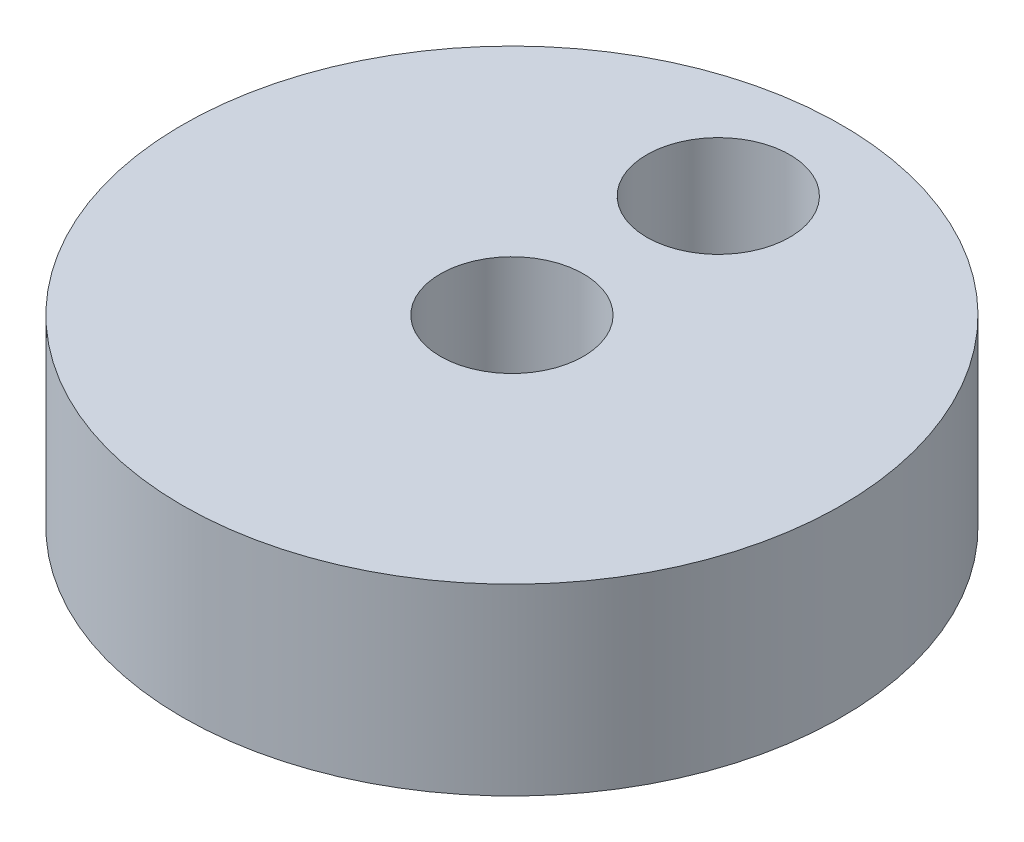
ISO-10303-21;
HEADER;
FILE_DESCRIPTION(('STEP AP214'),'2;1');
FILE_NAME('part.step','',(''),(''),'','','');
FILE_SCHEMA(('AUTOMOTIVE_DESIGN { 1 0 10303 214 1 1 1 1 }'));
ENDSEC;
DATA;
#1=APPLICATION_CONTEXT('core data for automotive mechanical design processes');
#2=APPLICATION_PROTOCOL_DEFINITION('international standard','automotive_design',2000,#1);
#3=PRODUCT_CONTEXT('',#1,'mechanical');
#4=PRODUCT('Part','Part','',(#3));
#5=PRODUCT_RELATED_PRODUCT_CATEGORY('part','',(#4));
#6=PRODUCT_DEFINITION_FORMATION('','',#4);
#7=PRODUCT_DEFINITION_CONTEXT('part definition',#1,'design');
#8=PRODUCT_DEFINITION('design','',#6,#7);
#9=PRODUCT_DEFINITION_SHAPE('','',#8);
#10=(LENGTH_UNIT() NAMED_UNIT(*) SI_UNIT(.MILLI.,.METRE.));
#11=(NAMED_UNIT(*) PLANE_ANGLE_UNIT() SI_UNIT($,.RADIAN.));
#12=(NAMED_UNIT(*) SI_UNIT($,.STERADIAN.) SOLID_ANGLE_UNIT());
#13=UNCERTAINTY_MEASURE_WITH_UNIT(LENGTH_MEASURE(1.E-05),#10,'distance_accuracy_value','');
#14=(GEOMETRIC_REPRESENTATION_CONTEXT(3) GLOBAL_UNCERTAINTY_ASSIGNED_CONTEXT((#13)) GLOBAL_UNIT_ASSIGNED_CONTEXT((#10,
#11,#12)) REPRESENTATION_CONTEXT('',''));
#15=CARTESIAN_POINT('',(0.,0.,0.));
#16=DIRECTION('',(0.,0.,1.));
#17=DIRECTION('',(1.,0.,0.));
#18=AXIS2_PLACEMENT_3D('',#15,#16,#17);
#19=CARTESIAN_POINT('',(0.,-15.24,0.));
#20=DIRECTION('',(0.,1.,0.));
#21=DIRECTION('',(0.,0.,1.));
#22=AXIS2_PLACEMENT_3D('',#19,#20,#21);
#23=CYLINDRICAL_SURFACE('',#22,27.3812);
#24=CARTESIAN_POINT('',(0.,-15.24,0.));
#25=DIRECTION('',(0.,1.,0.));
#26=DIRECTION('',(0.,0.,1.));
#27=AXIS2_PLACEMENT_3D('',#24,#25,#26);
#28=CIRCLE('',#27,27.3812);
#29=CARTESIAN_POINT('',(0.,-15.24,27.3812));
#30=VERTEX_POINT('',#29);
#31=EDGE_CURVE('E19',#30,#30,#28,.T.);
#32=ORIENTED_EDGE('',*,*,#31,.T.);
#33=EDGE_LOOP('',(#32));
#34=FACE_BOUND('',#33,.T.);
#35=CARTESIAN_POINT('',(0.,0.,0.));
#36=DIRECTION('',(0.,1.,0.));
#37=DIRECTION('',(0.,0.,1.));
#38=AXIS2_PLACEMENT_3D('',#35,#36,#37);
#39=CIRCLE('',#38,27.3812);
#40=CARTESIAN_POINT('',(0.,0.,27.3812));
#41=VERTEX_POINT('',#40);
#42=EDGE_CURVE('E33',#41,#41,#39,.T.);
#43=ORIENTED_EDGE('',*,*,#42,.F.);
#44=EDGE_LOOP('',(#43));
#45=FACE_BOUND('',#44,.T.);
#46=ADVANCED_FACE('F15',(#34,#45),#23,.T.);
#47=CARTESIAN_POINT('',(0.,-15.24,0.));
#48=DIRECTION('',(0.,1.,0.));
#49=DIRECTION('',(0.,0.,1.));
#50=AXIS2_PLACEMENT_3D('',#47,#48,#49);
#51=CYLINDRICAL_SURFACE('',#50,5.9436);
#52=CARTESIAN_POINT('',(0.,0.,0.));
#53=DIRECTION('',(0.,1.,0.));
#54=DIRECTION('',(0.,0.,1.));
#55=AXIS2_PLACEMENT_3D('',#52,#53,#54);
#56=CIRCLE('',#55,5.9436);
#57=CARTESIAN_POINT('',(0.,0.,5.9436));
#58=VERTEX_POINT('',#57);
#59=EDGE_CURVE('E28',#58,#58,#56,.F.);
#60=ORIENTED_EDGE('',*,*,#59,.F.);
#61=EDGE_LOOP('',(#60));
#62=FACE_BOUND('',#61,.T.);
#63=CARTESIAN_POINT('',(0.,-15.24,0.));
#64=DIRECTION('',(0.,1.,0.));
#65=DIRECTION('',(0.,0.,1.));
#66=AXIS2_PLACEMENT_3D('',#63,#64,#65);
#67=CIRCLE('',#66,5.9436);
#68=CARTESIAN_POINT('',(0.,-15.24,5.9436));
#69=VERTEX_POINT('',#68);
#70=EDGE_CURVE('E35',#69,#69,#67,.F.);
#71=ORIENTED_EDGE('',*,*,#70,.T.);
#72=EDGE_LOOP('',(#71));
#73=FACE_BOUND('',#72,.T.);
#74=ADVANCED_FACE('F46',(#62,#73),#51,.F.);
#75=CARTESIAN_POINT('',(-27.7097744,-15.24,-27.7097744));
#76=DIRECTION('',(0.,1.,0.));
#77=DIRECTION('',(0.,0.,1.));
#78=AXIS2_PLACEMENT_3D('',#75,#76,#77);
#79=PLANE('',#78);
#80=ORIENTED_EDGE('',*,*,#70,.F.);
#81=EDGE_LOOP('',(#80));
#82=FACE_BOUND('',#81,.T.);
#83=CARTESIAN_POINT('',(0.,-15.24,-17.145));
#84=DIRECTION('',(0.,1.,0.));
#85=DIRECTION('',(0.,0.,1.));
#86=AXIS2_PLACEMENT_3D('',#83,#84,#85);
#87=CIRCLE('',#86,5.9436);
#88=CARTESIAN_POINT('',(0.,-15.24,-11.2014));
#89=VERTEX_POINT('',#88);
#90=EDGE_CURVE('E23',#89,#89,#87,.F.);
#91=ORIENTED_EDGE('',*,*,#90,.F.);
#92=EDGE_LOOP('',(#91));
#93=FACE_BOUND('',#92,.T.);
#94=ORIENTED_EDGE('',*,*,#31,.F.);
#95=EDGE_LOOP('',(#94));
#96=FACE_BOUND('',#95,.T.);
#97=ADVANCED_FACE('F44',(#82,#93,#96),#79,.F.);
#98=CARTESIAN_POINT('',(-27.7097744,0.,-27.7097744));
#99=DIRECTION('',(0.,1.,0.));
#100=DIRECTION('',(0.,0.,1.));
#101=AXIS2_PLACEMENT_3D('',#98,#99,#100);
#102=PLANE('',#101);
#103=ORIENTED_EDGE('',*,*,#59,.T.);
#104=EDGE_LOOP('',(#103));
#105=FACE_BOUND('',#104,.T.);
#106=CARTESIAN_POINT('',(0.,0.,-17.145));
#107=DIRECTION('',(0.,1.,0.));
#108=DIRECTION('',(0.,0.,1.));
#109=AXIS2_PLACEMENT_3D('',#106,#107,#108);
#110=CIRCLE('',#109,5.9436);
#111=CARTESIAN_POINT('',(0.,0.,-11.2014));
#112=VERTEX_POINT('',#111);
#113=EDGE_CURVE('E10',#112,#112,#110,.T.);
#114=ORIENTED_EDGE('',*,*,#113,.F.);
#115=EDGE_LOOP('',(#114));
#116=FACE_BOUND('',#115,.T.);
#117=ORIENTED_EDGE('',*,*,#42,.T.);
#118=EDGE_LOOP('',(#117));
#119=FACE_BOUND('',#118,.T.);
#120=ADVANCED_FACE('F17',(#105,#116,#119),#102,.T.);
#121=CARTESIAN_POINT('',(0.,-15.24,-17.145));
#122=DIRECTION('',(0.,1.,0.));
#123=DIRECTION('',(0.,0.,1.));
#124=AXIS2_PLACEMENT_3D('',#121,#122,#123);
#125=CYLINDRICAL_SURFACE('',#124,5.9436);
#126=ORIENTED_EDGE('',*,*,#113,.T.);
#127=EDGE_LOOP('',(#126));
#128=FACE_BOUND('',#127,.T.);
#129=ORIENTED_EDGE('',*,*,#90,.T.);
#130=EDGE_LOOP('',(#129));
#131=FACE_BOUND('',#130,.T.);
#132=ADVANCED_FACE('F53',(#128,#131),#125,.F.);
#133=CLOSED_SHELL('',(#46,#74,#97,#120,#132));
#134=MANIFOLD_SOLID_BREP('B1',#133);
#135=ADVANCED_BREP_SHAPE_REPRESENTATION('',(#18,#134),#14);
#136=SHAPE_DEFINITION_REPRESENTATION(#9,#135);
ENDSEC;
END-ISO-10303-21;
